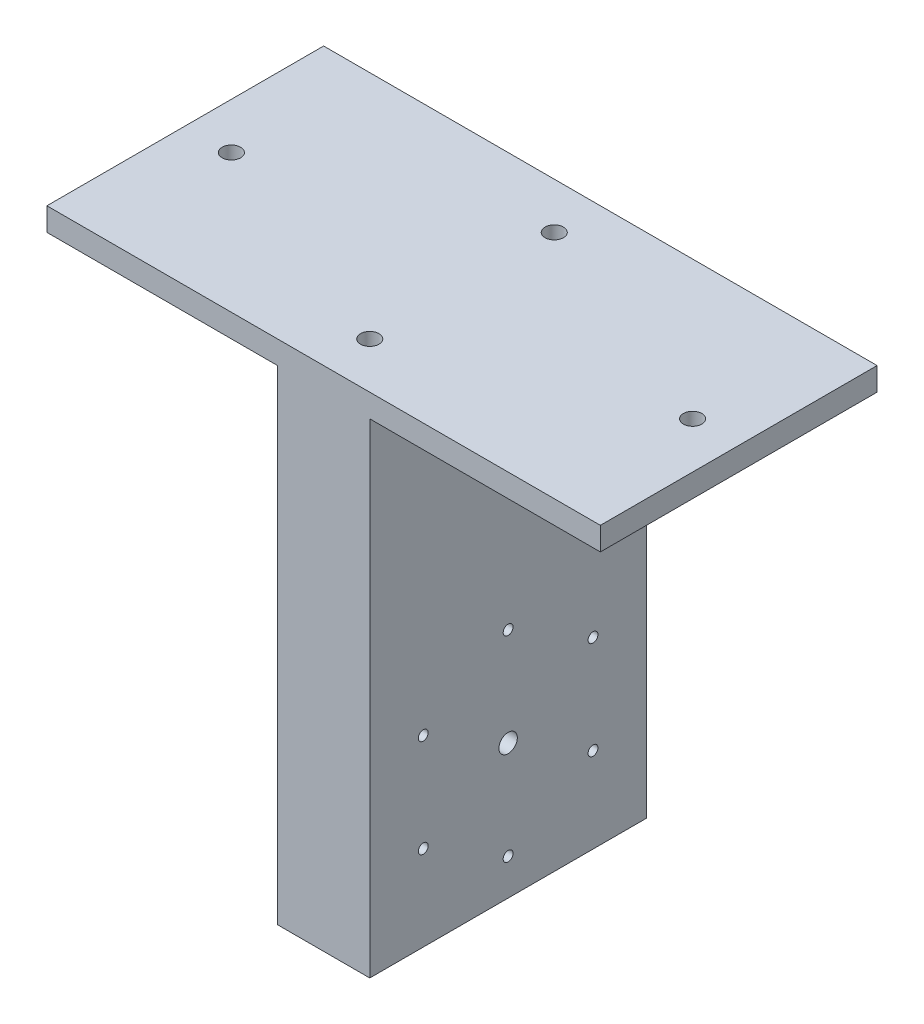
ISO-10303-21;
HEADER;
FILE_DESCRIPTION(('STEP AP214'),'2;1');
FILE_NAME('part.step','',(''),(''),'','','');
FILE_SCHEMA(('AUTOMOTIVE_DESIGN { 1 0 10303 214 1 1 1 1 }'));
ENDSEC;
DATA;
#1=APPLICATION_CONTEXT('core data for automotive mechanical design processes');
#2=APPLICATION_PROTOCOL_DEFINITION('international standard','automotive_design',2000,#1);
#3=PRODUCT_CONTEXT('',#1,'mechanical');
#4=PRODUCT('Part','Part','',(#3));
#5=PRODUCT_RELATED_PRODUCT_CATEGORY('part','',(#4));
#6=PRODUCT_DEFINITION_FORMATION('','',#4);
#7=PRODUCT_DEFINITION_CONTEXT('part definition',#1,'design');
#8=PRODUCT_DEFINITION('design','',#6,#7);
#9=PRODUCT_DEFINITION_SHAPE('','',#8);
#10=(LENGTH_UNIT() NAMED_UNIT(*) SI_UNIT(.MILLI.,.METRE.));
#11=(NAMED_UNIT(*) PLANE_ANGLE_UNIT() SI_UNIT($,.RADIAN.));
#12=(NAMED_UNIT(*) SI_UNIT($,.STERADIAN.) SOLID_ANGLE_UNIT());
#13=UNCERTAINTY_MEASURE_WITH_UNIT(LENGTH_MEASURE(1.E-05),#10,'distance_accuracy_value','');
#14=(GEOMETRIC_REPRESENTATION_CONTEXT(3) GLOBAL_UNCERTAINTY_ASSIGNED_CONTEXT((#13)) GLOBAL_UNIT_ASSIGNED_CONTEXT((#10,
#11,#12)) REPRESENTATION_CONTEXT('',''));
#15=CARTESIAN_POINT('',(0.,0.,0.));
#16=DIRECTION('',(0.,0.,1.));
#17=DIRECTION('',(1.,0.,0.));
#18=AXIS2_PLACEMENT_3D('',#15,#16,#17);
#19=CARTESIAN_POINT('',(-100.,210.,120.));
#20=DIRECTION('',(0.,1.,0.));
#21=DIRECTION('',(0.,0.,1.));
#22=AXIS2_PLACEMENT_3D('',#19,#20,#21);
#23=PLANE('',#22);
#24=CARTESIAN_POINT('',(-80.,210.,60.));
#25=DIRECTION('',(0.,1.,0.));
#26=DIRECTION('',(-1.,0.,0.));
#27=AXIS2_PLACEMENT_3D('',#24,#25,#26);
#28=CIRCLE('',#27,4.00000000000001);
#29=CARTESIAN_POINT('',(-84.,210.,60.));
#30=VERTEX_POINT('',#29);
#31=EDGE_CURVE('E168',#30,#30,#28,.T.);
#32=ORIENTED_EDGE('',*,*,#31,.T.);
#33=EDGE_LOOP('',(#32));
#34=FACE_BOUND('',#33,.T.);
#35=DIRECTION('',(1.,0.,0.));
#36=VECTOR('',#35,1.);
#37=CARTESIAN_POINT('',(-100.,210.,0.));
#38=LINE('',#37,#36);
#39=CARTESIAN_POINT('',(-100.,210.,0.));
#40=VERTEX_POINT('',#39);
#41=CARTESIAN_POINT('',(0.,210.,0.));
#42=VERTEX_POINT('',#41);
#43=EDGE_CURVE('E137',#40,#42,#38,.T.);
#44=ORIENTED_EDGE('',*,*,#43,.T.);
#45=DIRECTION('',(0.,0.,-1.));
#46=VECTOR('',#45,1.);
#47=CARTESIAN_POINT('',(0.,210.,120.));
#48=LINE('',#47,#46);
#49=CARTESIAN_POINT('',(0.,210.,120.));
#50=VERTEX_POINT('',#49);
#51=EDGE_CURVE('E11',#50,#42,#48,.T.);
#52=ORIENTED_EDGE('',*,*,#51,.F.);
#53=DIRECTION('',(1.,0.,0.));
#54=VECTOR('',#53,1.);
#55=CARTESIAN_POINT('',(-100.,210.,120.));
#56=LINE('',#55,#54);
#57=CARTESIAN_POINT('',(-100.,210.,120.));
#58=VERTEX_POINT('',#57);
#59=EDGE_CURVE('E152',#58,#50,#56,.T.);
#60=ORIENTED_EDGE('',*,*,#59,.F.);
#61=DIRECTION('',(0.,0.,-1.));
#62=VECTOR('',#61,1.);
#63=CARTESIAN_POINT('',(-100.,210.,120.));
#64=LINE('',#63,#62);
#65=EDGE_CURVE('E133',#58,#40,#64,.T.);
#66=ORIENTED_EDGE('',*,*,#65,.T.);
#67=EDGE_LOOP('',(#44,#52,#60,#66));
#68=FACE_BOUND('',#67,.T.);
#69=ADVANCED_FACE('F39',(#34,#68),#23,.F.);
#70=CARTESIAN_POINT('',(0.,210.,120.));
#71=DIRECTION('',(1.,0.,0.));
#72=DIRECTION('',(0.,1.,0.));
#73=AXIS2_PLACEMENT_3D('',#70,#71,#72);
#74=PLANE('',#73);
#75=CARTESIAN_POINT('',(0.,36.9999999999993,96.8060796608371));
#76=DIRECTION('',(1.,0.,0.));
#77=DIRECTION('',(0.,1.,0.));
#78=AXIS2_PLACEMENT_3D('',#75,#76,#77);
#79=CIRCLE('',#78,2.1390348348326);
#80=CARTESIAN_POINT('',(0.,39.1390348348319,96.8060796608371));
#81=VERTEX_POINT('',#80);
#82=EDGE_CURVE('E141',#81,#81,#79,.T.);
#83=ORIENTED_EDGE('',*,*,#82,.T.);
#84=EDGE_LOOP('',(#83));
#85=FACE_BOUND('',#84,.T.);
#86=CARTESIAN_POINT('',(0.,15.75,59.9999999999979));
#87=DIRECTION('',(1.,0.,0.));
#88=DIRECTION('',(0.,1.,0.));
#89=AXIS2_PLACEMENT_3D('',#86,#87,#88);
#90=CIRCLE('',#89,2.13903483483261);
#91=CARTESIAN_POINT('',(0.,17.8890348348326,59.9999999999979));
#92=VERTEX_POINT('',#91);
#93=EDGE_CURVE('E217',#92,#92,#90,.T.);
#94=ORIENTED_EDGE('',*,*,#93,.T.);
#95=EDGE_LOOP('',(#94));
#96=FACE_BOUND('',#95,.T.);
#97=CARTESIAN_POINT('',(0.,37.0000000000009,23.1939203391597));
#98=DIRECTION('',(1.,0.,0.));
#99=DIRECTION('',(0.,1.,0.));
#100=AXIS2_PLACEMENT_3D('',#97,#98,#99);
#101=CIRCLE('',#100,2.1390348348326);
#102=CARTESIAN_POINT('',(0.,39.1390348348335,23.1939203391597));
#103=VERTEX_POINT('',#102);
#104=EDGE_CURVE('E214',#103,#103,#101,.T.);
#105=ORIENTED_EDGE('',*,*,#104,.T.);
#106=EDGE_LOOP('',(#105));
#107=FACE_BOUND('',#106,.T.);
#108=CARTESIAN_POINT('',(0.,100.75,60.));
#109=DIRECTION('',(1.,0.,0.));
#110=DIRECTION('',(0.,1.,0.));
#111=AXIS2_PLACEMENT_3D('',#108,#109,#110);
#112=CIRCLE('',#111,2.1390348348326);
#113=CARTESIAN_POINT('',(0.,102.889034834833,60.));
#114=VERTEX_POINT('',#113);
#115=EDGE_CURVE('E211',#114,#114,#112,.T.);
#116=ORIENTED_EDGE('',*,*,#115,.T.);
#117=EDGE_LOOP('',(#116));
#118=FACE_BOUND('',#117,.T.);
#119=CARTESIAN_POINT('',(0.,79.4999999999994,96.8060796608378));
#120=DIRECTION('',(1.,0.,0.));
#121=DIRECTION('',(0.,1.,0.));
#122=AXIS2_PLACEMENT_3D('',#119,#120,#121);
#123=CIRCLE('',#122,2.1390348348326);
#124=CARTESIAN_POINT('',(0.,81.639034834832,96.8060796608378));
#125=VERTEX_POINT('',#124);
#126=EDGE_CURVE('E208',#125,#125,#123,.T.);
#127=ORIENTED_EDGE('',*,*,#126,.T.);
#128=EDGE_LOOP('',(#127));
#129=FACE_BOUND('',#128,.T.);
#130=CARTESIAN_POINT('',(0.,58.25,60.));
#131=DIRECTION('',(1.,0.,0.));
#132=DIRECTION('',(0.,1.,0.));
#133=AXIS2_PLACEMENT_3D('',#130,#131,#132);
#134=CIRCLE('',#133,4.);
#135=CARTESIAN_POINT('',(0.,62.25,60.));
#136=VERTEX_POINT('',#135);
#137=EDGE_CURVE('E205',#136,#136,#134,.T.);
#138=ORIENTED_EDGE('',*,*,#137,.T.);
#139=EDGE_LOOP('',(#138));
#140=FACE_BOUND('',#139,.T.);
#141=CARTESIAN_POINT('',(0.,79.500000000001,23.1939203391607));
#142=DIRECTION('',(1.,0.,0.));
#143=DIRECTION('',(0.,1.,0.));
#144=AXIS2_PLACEMENT_3D('',#141,#142,#143);
#145=CIRCLE('',#144,2.13903483483259);
#146=CARTESIAN_POINT('',(0.,81.6390348348336,23.1939203391607));
#147=VERTEX_POINT('',#146);
#148=EDGE_CURVE('E202',#147,#147,#145,.T.);
#149=ORIENTED_EDGE('',*,*,#148,.T.);
#150=EDGE_LOOP('',(#149));
#151=FACE_BOUND('',#150,.T.);
#152=DIRECTION('',(0.,-1.,0.));
#153=VECTOR('',#152,1.);
#154=CARTESIAN_POINT('',(0.,210.,0.));
#155=LINE('',#154,#153);
#156=CARTESIAN_POINT('',(0.,0.,0.));
#157=VERTEX_POINT('',#156);
#158=EDGE_CURVE('E140',#42,#157,#155,.T.);
#159=ORIENTED_EDGE('',*,*,#158,.T.);
#160=DIRECTION('',(0.,0.,-1.));
#161=VECTOR('',#160,1.);
#162=CARTESIAN_POINT('',(0.,0.,120.));
#163=LINE('',#162,#161);
#164=CARTESIAN_POINT('',(0.,0.,120.));
#165=VERTEX_POINT('',#164);
#166=EDGE_CURVE('E48',#165,#157,#163,.T.);
#167=ORIENTED_EDGE('',*,*,#166,.F.);
#168=DIRECTION('',(0.,-1.,0.));
#169=VECTOR('',#168,1.);
#170=CARTESIAN_POINT('',(0.,210.,120.));
#171=LINE('',#170,#169);
#172=EDGE_CURVE('E100',#50,#165,#171,.T.);
#173=ORIENTED_EDGE('',*,*,#172,.F.);
#174=ORIENTED_EDGE('',*,*,#51,.T.);
#175=EDGE_LOOP('',(#159,#167,#173,#174));
#176=FACE_BOUND('',#175,.T.);
#177=ADVANCED_FACE('F257',(#85,#96,#107,#118,#129,#140,#151,#176),#74,.F.);
#178=CARTESIAN_POINT('',(0.,0.,120.));
#179=DIRECTION('',(0.,1.,0.));
#180=DIRECTION('',(0.,0.,1.));
#181=AXIS2_PLACEMENT_3D('',#178,#179,#180);
#182=PLANE('',#181);
#183=DIRECTION('',(1.,0.,0.));
#184=VECTOR('',#183,1.);
#185=CARTESIAN_POINT('',(0.,0.,0.));
#186=LINE('',#185,#184);
#187=CARTESIAN_POINT('',(40.,0.,0.));
#188=VERTEX_POINT('',#187);
#189=EDGE_CURVE('E143',#157,#188,#186,.T.);
#190=ORIENTED_EDGE('',*,*,#189,.T.);
#191=DIRECTION('',(0.,0.,-1.));
#192=VECTOR('',#191,1.);
#193=CARTESIAN_POINT('',(40.,0.,120.));
#194=LINE('',#193,#192);
#195=CARTESIAN_POINT('',(40.,0.,120.));
#196=VERTEX_POINT('',#195);
#197=EDGE_CURVE('E159',#196,#188,#194,.T.);
#198=ORIENTED_EDGE('',*,*,#197,.F.);
#199=DIRECTION('',(1.,0.,0.));
#200=VECTOR('',#199,1.);
#201=CARTESIAN_POINT('',(0.,0.,120.));
#202=LINE('',#201,#200);
#203=EDGE_CURVE('E224',#165,#196,#202,.T.);
#204=ORIENTED_EDGE('',*,*,#203,.F.);
#205=ORIENTED_EDGE('',*,*,#166,.T.);
#206=EDGE_LOOP('',(#190,#198,#204,#205));
#207=FACE_BOUND('',#206,.T.);
#208=ADVANCED_FACE('F264',(#207),#182,.F.);
#209=CARTESIAN_POINT('',(40.,0.,120.));
#210=DIRECTION('',(-1.,0.,0.));
#211=DIRECTION('',(0.,0.,1.));
#212=AXIS2_PLACEMENT_3D('',#209,#210,#211);
#213=PLANE('',#212);
#214=CARTESIAN_POINT('',(40.,36.9999999999993,96.8060796608371));
#215=DIRECTION('',(1.,0.,0.));
#216=DIRECTION('',(0.,0.,-1.));
#217=AXIS2_PLACEMENT_3D('',#214,#215,#216);
#218=CIRCLE('',#217,2.1390348348326);
#219=CARTESIAN_POINT('',(40.,36.9999999999993,94.6670448260045));
#220=VERTEX_POINT('',#219);
#221=EDGE_CURVE('E184',#220,#220,#218,.T.);
#222=ORIENTED_EDGE('',*,*,#221,.F.);
#223=EDGE_LOOP('',(#222));
#224=FACE_BOUND('',#223,.T.);
#225=CARTESIAN_POINT('',(40.,15.75,59.9999999999979));
#226=DIRECTION('',(1.,0.,0.));
#227=DIRECTION('',(0.,0.,-1.));
#228=AXIS2_PLACEMENT_3D('',#225,#226,#227);
#229=CIRCLE('',#228,2.13903483483261);
#230=CARTESIAN_POINT('',(40.,15.75,57.8609651651653));
#231=VERTEX_POINT('',#230);
#232=EDGE_CURVE('E188',#231,#231,#229,.T.);
#233=ORIENTED_EDGE('',*,*,#232,.F.);
#234=EDGE_LOOP('',(#233));
#235=FACE_BOUND('',#234,.T.);
#236=CARTESIAN_POINT('',(40.,37.0000000000009,23.1939203391597));
#237=DIRECTION('',(1.,0.,0.));
#238=DIRECTION('',(0.,0.,-1.));
#239=AXIS2_PLACEMENT_3D('',#236,#237,#238);
#240=CIRCLE('',#239,2.1390348348326);
#241=CARTESIAN_POINT('',(40.,37.0000000000009,21.054885504327));
#242=VERTEX_POINT('',#241);
#243=EDGE_CURVE('E191',#242,#242,#240,.T.);
#244=ORIENTED_EDGE('',*,*,#243,.F.);
#245=EDGE_LOOP('',(#244));
#246=FACE_BOUND('',#245,.T.);
#247=CARTESIAN_POINT('',(40.,100.75,60.));
#248=DIRECTION('',(1.,0.,0.));
#249=DIRECTION('',(0.,0.,-1.));
#250=AXIS2_PLACEMENT_3D('',#247,#248,#249);
#251=CIRCLE('',#250,2.1390348348326);
#252=CARTESIAN_POINT('',(40.,100.75,57.8609651651674));
#253=VERTEX_POINT('',#252);
#254=EDGE_CURVE('E194',#253,#253,#251,.T.);
#255=ORIENTED_EDGE('',*,*,#254,.F.);
#256=EDGE_LOOP('',(#255));
#257=FACE_BOUND('',#256,.T.);
#258=CARTESIAN_POINT('',(40.,79.4999999999994,96.8060796608378));
#259=DIRECTION('',(1.,0.,0.));
#260=DIRECTION('',(0.,0.,-1.));
#261=AXIS2_PLACEMENT_3D('',#258,#259,#260);
#262=CIRCLE('',#261,2.1390348348326);
#263=CARTESIAN_POINT('',(40.,79.4999999999994,94.6670448260052));
#264=VERTEX_POINT('',#263);
#265=EDGE_CURVE('E179',#264,#264,#262,.T.);
#266=ORIENTED_EDGE('',*,*,#265,.F.);
#267=EDGE_LOOP('',(#266));
#268=FACE_BOUND('',#267,.T.);
#269=CARTESIAN_POINT('',(40.,58.25,60.));
#270=DIRECTION('',(1.,0.,0.));
#271=DIRECTION('',(0.,0.,-1.));
#272=AXIS2_PLACEMENT_3D('',#269,#270,#271);
#273=CIRCLE('',#272,4.);
#274=CARTESIAN_POINT('',(40.,58.25,56.));
#275=VERTEX_POINT('',#274);
#276=EDGE_CURVE('E175',#275,#275,#273,.T.);
#277=ORIENTED_EDGE('',*,*,#276,.F.);
#278=EDGE_LOOP('',(#277));
#279=FACE_BOUND('',#278,.T.);
#280=CARTESIAN_POINT('',(40.,79.500000000001,23.1939203391607));
#281=DIRECTION('',(1.,0.,0.));
#282=DIRECTION('',(0.,0.,-1.));
#283=AXIS2_PLACEMENT_3D('',#280,#281,#282);
#284=CIRCLE('',#283,2.13903483483259);
#285=CARTESIAN_POINT('',(40.,79.500000000001,21.0548855043281));
#286=VERTEX_POINT('',#285);
#287=EDGE_CURVE('E197',#286,#286,#284,.T.);
#288=ORIENTED_EDGE('',*,*,#287,.F.);
#289=EDGE_LOOP('',(#288));
#290=FACE_BOUND('',#289,.T.);
#291=DIRECTION('',(0.,1.,0.));
#292=VECTOR('',#291,1.);
#293=CARTESIAN_POINT('',(40.,0.,0.));
#294=LINE('',#293,#292);
#295=CARTESIAN_POINT('',(40.,210.,0.));
#296=VERTEX_POINT('',#295);
#297=EDGE_CURVE('E145',#188,#296,#294,.T.);
#298=ORIENTED_EDGE('',*,*,#297,.T.);
#299=DIRECTION('',(0.,0.,-1.));
#300=VECTOR('',#299,1.);
#301=CARTESIAN_POINT('',(40.,210.,120.));
#302=LINE('',#301,#300);
#303=CARTESIAN_POINT('',(40.,210.,120.));
#304=VERTEX_POINT('',#303);
#305=EDGE_CURVE('E156',#304,#296,#302,.T.);
#306=ORIENTED_EDGE('',*,*,#305,.F.);
#307=DIRECTION('',(0.,1.,0.));
#308=VECTOR('',#307,1.);
#309=CARTESIAN_POINT('',(40.,0.,120.));
#310=LINE('',#309,#308);
#311=EDGE_CURVE('E226',#196,#304,#310,.T.);
#312=ORIENTED_EDGE('',*,*,#311,.F.);
#313=ORIENTED_EDGE('',*,*,#197,.T.);
#314=EDGE_LOOP('',(#298,#306,#312,#313));
#315=FACE_BOUND('',#314,.T.);
#316=ADVANCED_FACE('F232',(#224,#235,#246,#257,#268,#279,#290,#315),#213,.F.);
#317=CARTESIAN_POINT('',(40.,210.,120.));
#318=DIRECTION('',(0.,1.,0.));
#319=DIRECTION('',(0.,0.,1.));
#320=AXIS2_PLACEMENT_3D('',#317,#318,#319);
#321=PLANE('',#320);
#322=CARTESIAN_POINT('',(120.,210.,60.));
#323=DIRECTION('',(0.,1.,0.));
#324=DIRECTION('',(-1.,0.,0.));
#325=AXIS2_PLACEMENT_3D('',#322,#323,#324);
#326=CIRCLE('',#325,3.99999999999999);
#327=CARTESIAN_POINT('',(116.,210.,60.));
#328=VERTEX_POINT('',#327);
#329=EDGE_CURVE('E272',#328,#328,#326,.T.);
#330=ORIENTED_EDGE('',*,*,#329,.T.);
#331=EDGE_LOOP('',(#330));
#332=FACE_BOUND('',#331,.T.);
#333=DIRECTION('',(1.,0.,0.));
#334=VECTOR('',#333,1.);
#335=CARTESIAN_POINT('',(40.,210.,0.));
#336=LINE('',#335,#334);
#337=CARTESIAN_POINT('',(140.,210.,0.));
#338=VERTEX_POINT('',#337);
#339=EDGE_CURVE('E147',#296,#338,#336,.T.);
#340=ORIENTED_EDGE('',*,*,#339,.T.);
#341=DIRECTION('',(0.,0.,-1.));
#342=VECTOR('',#341,1.);
#343=CARTESIAN_POINT('',(140.,210.,120.));
#344=LINE('',#343,#342);
#345=CARTESIAN_POINT('',(140.,210.,120.));
#346=VERTEX_POINT('',#345);
#347=EDGE_CURVE('E128',#346,#338,#344,.T.);
#348=ORIENTED_EDGE('',*,*,#347,.F.);
#349=DIRECTION('',(1.,0.,0.));
#350=VECTOR('',#349,1.);
#351=CARTESIAN_POINT('',(40.,210.,120.));
#352=LINE('',#351,#350);
#353=EDGE_CURVE('E119',#304,#346,#352,.T.);
#354=ORIENTED_EDGE('',*,*,#353,.F.);
#355=ORIENTED_EDGE('',*,*,#305,.T.);
#356=EDGE_LOOP('',(#340,#348,#354,#355));
#357=FACE_BOUND('',#356,.T.);
#358=ADVANCED_FACE('F236',(#332,#357),#321,.F.);
#359=CARTESIAN_POINT('',(140.,210.,120.));
#360=DIRECTION('',(-1.,0.,0.));
#361=DIRECTION('',(0.,0.,1.));
#362=AXIS2_PLACEMENT_3D('',#359,#360,#361);
#363=PLANE('',#362);
#364=DIRECTION('',(0.,1.,0.));
#365=VECTOR('',#364,1.);
#366=CARTESIAN_POINT('',(140.,210.,0.));
#367=LINE('',#366,#365);
#368=CARTESIAN_POINT('',(140.,220.,0.));
#369=VERTEX_POINT('',#368);
#370=EDGE_CURVE('E127',#338,#369,#367,.T.);
#371=ORIENTED_EDGE('',*,*,#370,.T.);
#372=DIRECTION('',(0.,0.,-1.));
#373=VECTOR('',#372,1.);
#374=CARTESIAN_POINT('',(140.,220.,120.));
#375=LINE('',#374,#373);
#376=CARTESIAN_POINT('',(140.,220.,120.));
#377=VERTEX_POINT('',#376);
#378=EDGE_CURVE('E124',#377,#369,#375,.T.);
#379=ORIENTED_EDGE('',*,*,#378,.F.);
#380=DIRECTION('',(0.,1.,0.));
#381=VECTOR('',#380,1.);
#382=CARTESIAN_POINT('',(140.,210.,120.));
#383=LINE('',#382,#381);
#384=EDGE_CURVE('E113',#346,#377,#383,.T.);
#385=ORIENTED_EDGE('',*,*,#384,.F.);
#386=ORIENTED_EDGE('',*,*,#347,.T.);
#387=EDGE_LOOP('',(#371,#379,#385,#386));
#388=FACE_BOUND('',#387,.T.);
#389=ADVANCED_FACE('F125',(#388),#363,.F.);
#390=CARTESIAN_POINT('',(140.,220.,120.));
#391=DIRECTION('',(0.,-1.,0.));
#392=DIRECTION('',(1.,0.,0.));
#393=AXIS2_PLACEMENT_3D('',#390,#391,#392);
#394=PLANE('',#393);
#395=CARTESIAN_POINT('',(-80.,220.,60.));
#396=DIRECTION('',(0.,-1.,0.));
#397=DIRECTION('',(1.,0.,0.));
#398=AXIS2_PLACEMENT_3D('',#395,#396,#397);
#399=CIRCLE('',#398,4.00000000000001);
#400=CARTESIAN_POINT('',(-76.,220.,60.));
#401=VERTEX_POINT('',#400);
#402=EDGE_CURVE('E42',#401,#401,#399,.F.);
#403=ORIENTED_EDGE('',*,*,#402,.F.);
#404=EDGE_LOOP('',(#403));
#405=FACE_BOUND('',#404,.T.);
#406=CARTESIAN_POINT('',(20.,220.,20.));
#407=DIRECTION('',(0.,-1.,0.));
#408=DIRECTION('',(1.,0.,0.));
#409=AXIS2_PLACEMENT_3D('',#406,#407,#408);
#410=CIRCLE('',#409,4.);
#411=CARTESIAN_POINT('',(24.,220.,20.));
#412=VERTEX_POINT('',#411);
#413=EDGE_CURVE('E170',#412,#412,#410,.F.);
#414=ORIENTED_EDGE('',*,*,#413,.F.);
#415=EDGE_LOOP('',(#414));
#416=FACE_BOUND('',#415,.T.);
#417=CARTESIAN_POINT('',(120.,220.,60.));
#418=DIRECTION('',(0.,-1.,0.));
#419=DIRECTION('',(1.,0.,0.));
#420=AXIS2_PLACEMENT_3D('',#417,#418,#419);
#421=CIRCLE('',#420,3.99999999999999);
#422=CARTESIAN_POINT('',(124.,220.,60.));
#423=VERTEX_POINT('',#422);
#424=EDGE_CURVE('E167',#423,#423,#421,.F.);
#425=ORIENTED_EDGE('',*,*,#424,.F.);
#426=EDGE_LOOP('',(#425));
#427=FACE_BOUND('',#426,.T.);
#428=CARTESIAN_POINT('',(20.,220.,100.));
#429=DIRECTION('',(0.,-1.,0.));
#430=DIRECTION('',(1.,0.,0.));
#431=AXIS2_PLACEMENT_3D('',#428,#429,#430);
#432=CIRCLE('',#431,4.);
#433=CARTESIAN_POINT('',(24.,220.,100.));
#434=VERTEX_POINT('',#433);
#435=EDGE_CURVE('E164',#434,#434,#432,.F.);
#436=ORIENTED_EDGE('',*,*,#435,.F.);
#437=EDGE_LOOP('',(#436));
#438=FACE_BOUND('',#437,.T.);
#439=DIRECTION('',(-1.,0.,0.));
#440=VECTOR('',#439,1.);
#441=CARTESIAN_POINT('',(140.,220.,0.));
#442=LINE('',#441,#440);
#443=CARTESIAN_POINT('',(-100.,220.,0.));
#444=VERTEX_POINT('',#443);
#445=EDGE_CURVE('E86',#369,#444,#442,.T.);
#446=ORIENTED_EDGE('',*,*,#445,.T.);
#447=DIRECTION('',(0.,0.,-1.));
#448=VECTOR('',#447,1.);
#449=CARTESIAN_POINT('',(-100.,220.,120.));
#450=LINE('',#449,#448);
#451=CARTESIAN_POINT('',(-100.,220.,120.));
#452=VERTEX_POINT('',#451);
#453=EDGE_CURVE('E129',#452,#444,#450,.T.);
#454=ORIENTED_EDGE('',*,*,#453,.F.);
#455=DIRECTION('',(-1.,0.,0.));
#456=VECTOR('',#455,1.);
#457=CARTESIAN_POINT('',(140.,220.,120.));
#458=LINE('',#457,#456);
#459=EDGE_CURVE('E117',#377,#452,#458,.T.);
#460=ORIENTED_EDGE('',*,*,#459,.F.);
#461=ORIENTED_EDGE('',*,*,#378,.T.);
#462=EDGE_LOOP('',(#446,#454,#460,#461));
#463=FACE_BOUND('',#462,.T.);
#464=ADVANCED_FACE('F131',(#405,#416,#427,#438,#463),#394,.F.);
#465=CARTESIAN_POINT('',(-100.,220.,120.));
#466=DIRECTION('',(1.,0.,0.));
#467=DIRECTION('',(0.,0.,-1.));
#468=AXIS2_PLACEMENT_3D('',#465,#466,#467);
#469=PLANE('',#468);
#470=DIRECTION('',(0.,-1.,0.));
#471=VECTOR('',#470,1.);
#472=CARTESIAN_POINT('',(-100.,220.,0.));
#473=LINE('',#472,#471);
#474=EDGE_CURVE('E92',#444,#40,#473,.T.);
#475=ORIENTED_EDGE('',*,*,#474,.T.);
#476=ORIENTED_EDGE('',*,*,#65,.F.);
#477=DIRECTION('',(0.,-1.,0.));
#478=VECTOR('',#477,1.);
#479=CARTESIAN_POINT('',(-100.,220.,120.));
#480=LINE('',#479,#478);
#481=EDGE_CURVE('E57',#452,#58,#480,.T.);
#482=ORIENTED_EDGE('',*,*,#481,.F.);
#483=ORIENTED_EDGE('',*,*,#453,.T.);
#484=EDGE_LOOP('',(#475,#476,#482,#483));
#485=FACE_BOUND('',#484,.T.);
#486=ADVANCED_FACE('F244',(#485),#469,.F.);
#487=CARTESIAN_POINT('',(0.,0.,120.));
#488=DIRECTION('',(0.,0.,-1.));
#489=DIRECTION('',(-1.,0.,0.));
#490=AXIS2_PLACEMENT_3D('',#487,#488,#489);
#491=PLANE('',#490);
#492=ORIENTED_EDGE('',*,*,#59,.T.);
#493=ORIENTED_EDGE('',*,*,#172,.T.);
#494=ORIENTED_EDGE('',*,*,#203,.T.);
#495=ORIENTED_EDGE('',*,*,#311,.T.);
#496=ORIENTED_EDGE('',*,*,#353,.T.);
#497=ORIENTED_EDGE('',*,*,#384,.T.);
#498=ORIENTED_EDGE('',*,*,#459,.T.);
#499=ORIENTED_EDGE('',*,*,#481,.T.);
#500=EDGE_LOOP('',(#492,#493,#494,#495,#496,#497,#498,#499));
#501=FACE_BOUND('',#500,.T.);
#502=ADVANCED_FACE('F115',(#501),#491,.F.);
#503=CARTESIAN_POINT('',(0.,0.,0.));
#504=DIRECTION('',(0.,0.,-1.));
#505=DIRECTION('',(-1.,0.,0.));
#506=AXIS2_PLACEMENT_3D('',#503,#504,#505);
#507=PLANE('',#506);
#508=ORIENTED_EDGE('',*,*,#43,.F.);
#509=ORIENTED_EDGE('',*,*,#474,.F.);
#510=ORIENTED_EDGE('',*,*,#445,.F.);
#511=ORIENTED_EDGE('',*,*,#370,.F.);
#512=ORIENTED_EDGE('',*,*,#339,.F.);
#513=ORIENTED_EDGE('',*,*,#297,.F.);
#514=ORIENTED_EDGE('',*,*,#189,.F.);
#515=ORIENTED_EDGE('',*,*,#158,.F.);
#516=EDGE_LOOP('',(#508,#509,#510,#511,#512,#513,#514,#515));
#517=FACE_BOUND('',#516,.T.);
#518=ADVANCED_FACE('F239',(#517),#507,.T.);
#519=CARTESIAN_POINT('',(-60.,79.500000000001,23.1939203391607));
#520=DIRECTION('',(1.,0.,0.));
#521=DIRECTION('',(0.,0.,-1.));
#522=AXIS2_PLACEMENT_3D('',#519,#520,#521);
#523=CYLINDRICAL_SURFACE('',#522,2.13903483483259);
#524=ORIENTED_EDGE('',*,*,#287,.T.);
#525=EDGE_LOOP('',(#524));
#526=FACE_BOUND('',#525,.T.);
#527=ORIENTED_EDGE('',*,*,#148,.F.);
#528=EDGE_LOOP('',(#527));
#529=FACE_BOUND('',#528,.T.);
#530=ADVANCED_FACE('F309',(#526,#529),#523,.F.);
#531=CARTESIAN_POINT('',(-60.,58.25,60.));
#532=DIRECTION('',(1.,0.,0.));
#533=DIRECTION('',(0.,0.,-1.));
#534=AXIS2_PLACEMENT_3D('',#531,#532,#533);
#535=CYLINDRICAL_SURFACE('',#534,4.);
#536=ORIENTED_EDGE('',*,*,#276,.T.);
#537=EDGE_LOOP('',(#536));
#538=FACE_BOUND('',#537,.T.);
#539=ORIENTED_EDGE('',*,*,#137,.F.);
#540=EDGE_LOOP('',(#539));
#541=FACE_BOUND('',#540,.T.);
#542=ADVANCED_FACE('F305',(#538,#541),#535,.F.);
#543=CARTESIAN_POINT('',(-60.,79.4999999999994,96.8060796608378));
#544=DIRECTION('',(1.,0.,0.));
#545=DIRECTION('',(0.,0.,-1.));
#546=AXIS2_PLACEMENT_3D('',#543,#544,#545);
#547=CYLINDRICAL_SURFACE('',#546,2.1390348348326);
#548=ORIENTED_EDGE('',*,*,#265,.T.);
#549=EDGE_LOOP('',(#548));
#550=FACE_BOUND('',#549,.T.);
#551=ORIENTED_EDGE('',*,*,#126,.F.);
#552=EDGE_LOOP('',(#551));
#553=FACE_BOUND('',#552,.T.);
#554=ADVANCED_FACE('F301',(#550,#553),#547,.F.);
#555=CARTESIAN_POINT('',(-60.,100.75,60.));
#556=DIRECTION('',(1.,0.,0.));
#557=DIRECTION('',(0.,0.,-1.));
#558=AXIS2_PLACEMENT_3D('',#555,#556,#557);
#559=CYLINDRICAL_SURFACE('',#558,2.1390348348326);
#560=ORIENTED_EDGE('',*,*,#254,.T.);
#561=EDGE_LOOP('',(#560));
#562=FACE_BOUND('',#561,.T.);
#563=ORIENTED_EDGE('',*,*,#115,.F.);
#564=EDGE_LOOP('',(#563));
#565=FACE_BOUND('',#564,.T.);
#566=ADVANCED_FACE('F304',(#562,#565),#559,.F.);
#567=CARTESIAN_POINT('',(-60.,37.0000000000009,23.1939203391597));
#568=DIRECTION('',(1.,0.,0.));
#569=DIRECTION('',(0.,0.,-1.));
#570=AXIS2_PLACEMENT_3D('',#567,#568,#569);
#571=CYLINDRICAL_SURFACE('',#570,2.1390348348326);
#572=ORIENTED_EDGE('',*,*,#243,.T.);
#573=EDGE_LOOP('',(#572));
#574=FACE_BOUND('',#573,.T.);
#575=ORIENTED_EDGE('',*,*,#104,.F.);
#576=EDGE_LOOP('',(#575));
#577=FACE_BOUND('',#576,.T.);
#578=ADVANCED_FACE('F311',(#574,#577),#571,.F.);
#579=CARTESIAN_POINT('',(-60.,15.75,59.9999999999979));
#580=DIRECTION('',(1.,0.,0.));
#581=DIRECTION('',(0.,0.,-1.));
#582=AXIS2_PLACEMENT_3D('',#579,#580,#581);
#583=CYLINDRICAL_SURFACE('',#582,2.13903483483261);
#584=ORIENTED_EDGE('',*,*,#232,.T.);
#585=EDGE_LOOP('',(#584));
#586=FACE_BOUND('',#585,.T.);
#587=ORIENTED_EDGE('',*,*,#93,.F.);
#588=EDGE_LOOP('',(#587));
#589=FACE_BOUND('',#588,.T.);
#590=ADVANCED_FACE('F295',(#586,#589),#583,.F.);
#591=CARTESIAN_POINT('',(-60.,36.9999999999993,96.8060796608371));
#592=DIRECTION('',(1.,0.,0.));
#593=DIRECTION('',(0.,0.,-1.));
#594=AXIS2_PLACEMENT_3D('',#591,#592,#593);
#595=CYLINDRICAL_SURFACE('',#594,2.1390348348326);
#596=ORIENTED_EDGE('',*,*,#221,.T.);
#597=EDGE_LOOP('',(#596));
#598=FACE_BOUND('',#597,.T.);
#599=ORIENTED_EDGE('',*,*,#82,.F.);
#600=EDGE_LOOP('',(#599));
#601=FACE_BOUND('',#600,.T.);
#602=ADVANCED_FACE('F285',(#598,#601),#595,.F.);
#603=CARTESIAN_POINT('',(20.,220.000012,100.));
#604=DIRECTION('',(0.,-1.,0.));
#605=DIRECTION('',(1.,0.,0.));
#606=AXIS2_PLACEMENT_3D('',#603,#604,#605);
#607=CYLINDRICAL_SURFACE('',#606,4.);
#608=CARTESIAN_POINT('',(20.,210.,100.));
#609=DIRECTION('',(0.,1.,0.));
#610=DIRECTION('',(-1.,0.,0.));
#611=AXIS2_PLACEMENT_3D('',#608,#609,#610);
#612=CIRCLE('',#611,4.);
#613=CARTESIAN_POINT('',(16.,210.,100.));
#614=VERTEX_POINT('',#613);
#615=EDGE_CURVE('E276',#614,#614,#612,.T.);
#616=ORIENTED_EDGE('',*,*,#615,.F.);
#617=EDGE_LOOP('',(#616));
#618=FACE_BOUND('',#617,.T.);
#619=ORIENTED_EDGE('',*,*,#435,.T.);
#620=EDGE_LOOP('',(#619));
#621=FACE_BOUND('',#620,.T.);
#622=ADVANCED_FACE('F282',(#618,#621),#607,.F.);
#623=CARTESIAN_POINT('',(20.,210.,100.));
#624=DIRECTION('',(0.,1.,0.));
#625=DIRECTION('',(-1.,0.,0.));
#626=AXIS2_PLACEMENT_3D('',#623,#624,#625);
#627=PLANE('',#626);
#628=ORIENTED_EDGE('',*,*,#615,.T.);
#629=EDGE_LOOP('',(#628));
#630=FACE_BOUND('',#629,.T.);
#631=ADVANCED_FACE('F280',(#630),#627,.T.);
#632=CARTESIAN_POINT('',(120.,220.000012,60.));
#633=DIRECTION('',(0.,-1.,0.));
#634=DIRECTION('',(1.,0.,0.));
#635=AXIS2_PLACEMENT_3D('',#632,#633,#634);
#636=CYLINDRICAL_SURFACE('',#635,3.99999999999999);
#637=ORIENTED_EDGE('',*,*,#329,.F.);
#638=EDGE_LOOP('',(#637));
#639=FACE_BOUND('',#638,.T.);
#640=ORIENTED_EDGE('',*,*,#424,.T.);
#641=EDGE_LOOP('',(#640));
#642=FACE_BOUND('',#641,.T.);
#643=ADVANCED_FACE('F293',(#639,#642),#636,.F.);
#644=CARTESIAN_POINT('',(20.,220.000012,20.));
#645=DIRECTION('',(0.,-1.,0.));
#646=DIRECTION('',(1.,0.,0.));
#647=AXIS2_PLACEMENT_3D('',#644,#645,#646);
#648=CYLINDRICAL_SURFACE('',#647,4.);
#649=CARTESIAN_POINT('',(20.,210.,20.));
#650=DIRECTION('',(0.,1.,0.));
#651=DIRECTION('',(-1.,0.,0.));
#652=AXIS2_PLACEMENT_3D('',#649,#650,#651);
#653=CIRCLE('',#652,4.);
#654=CARTESIAN_POINT('',(16.,210.,20.));
#655=VERTEX_POINT('',#654);
#656=EDGE_CURVE('E269',#655,#655,#653,.T.);
#657=ORIENTED_EDGE('',*,*,#656,.F.);
#658=EDGE_LOOP('',(#657));
#659=FACE_BOUND('',#658,.T.);
#660=ORIENTED_EDGE('',*,*,#413,.T.);
#661=EDGE_LOOP('',(#660));
#662=FACE_BOUND('',#661,.T.);
#663=ADVANCED_FACE('F384',(#659,#662),#648,.F.);
#664=CARTESIAN_POINT('',(20.,210.,20.));
#665=DIRECTION('',(0.,1.,0.));
#666=DIRECTION('',(-1.,0.,0.));
#667=AXIS2_PLACEMENT_3D('',#664,#665,#666);
#668=PLANE('',#667);
#669=ORIENTED_EDGE('',*,*,#656,.T.);
#670=EDGE_LOOP('',(#669));
#671=FACE_BOUND('',#670,.T.);
#672=ADVANCED_FACE('F394',(#671),#668,.T.);
#673=CARTESIAN_POINT('',(-80.,220.000012,60.));
#674=DIRECTION('',(0.,-1.,0.));
#675=DIRECTION('',(1.,0.,0.));
#676=AXIS2_PLACEMENT_3D('',#673,#674,#675);
#677=CYLINDRICAL_SURFACE('',#676,4.00000000000001);
#678=ORIENTED_EDGE('',*,*,#31,.F.);
#679=EDGE_LOOP('',(#678));
#680=FACE_BOUND('',#679,.T.);
#681=ORIENTED_EDGE('',*,*,#402,.T.);
#682=EDGE_LOOP('',(#681));
#683=FACE_BOUND('',#682,.T.);
#684=ADVANCED_FACE('F405',(#680,#683),#677,.F.);
#685=CLOSED_SHELL('',(#69,#177,#208,#316,#358,#389,#464,#486,#502,#518,#530,#542,#554,#566,#578,
#590,#602,#622,#631,#643,#663,#672,#684));
#686=MANIFOLD_SOLID_BREP('B2',#685);
#687=ADVANCED_BREP_SHAPE_REPRESENTATION('',(#18,#686),#14);
#688=SHAPE_DEFINITION_REPRESENTATION(#9,#687);
ENDSEC;
END-ISO-10303-21;
